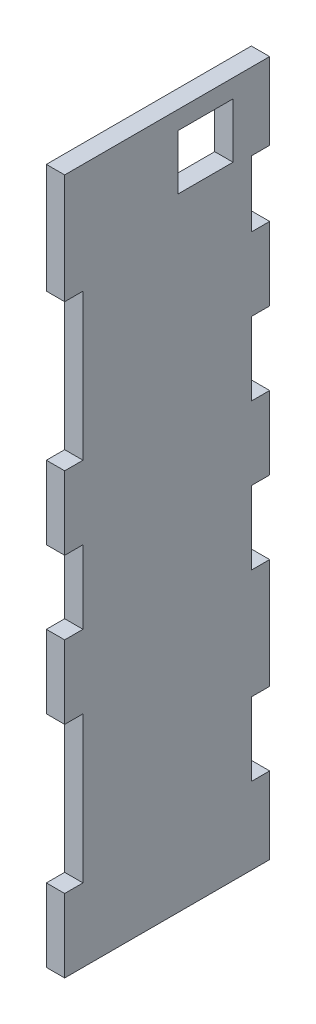
ISO-10303-21;
HEADER;
FILE_DESCRIPTION(('STEP AP214'),'2;1');
FILE_NAME('part.step','',(''),(''),'','','');
FILE_SCHEMA(('AUTOMOTIVE_DESIGN { 1 0 10303 214 1 1 1 1 }'));
ENDSEC;
DATA;
#1=APPLICATION_CONTEXT('core data for automotive mechanical design processes');
#2=APPLICATION_PROTOCOL_DEFINITION('international standard','automotive_design',2000,#1);
#3=PRODUCT_CONTEXT('',#1,'mechanical');
#4=PRODUCT('Part','Part','',(#3));
#5=PRODUCT_RELATED_PRODUCT_CATEGORY('part','',(#4));
#6=PRODUCT_DEFINITION_FORMATION('','',#4);
#7=PRODUCT_DEFINITION_CONTEXT('part definition',#1,'design');
#8=PRODUCT_DEFINITION('design','',#6,#7);
#9=PRODUCT_DEFINITION_SHAPE('','',#8);
#10=(LENGTH_UNIT() NAMED_UNIT(*) SI_UNIT(.MILLI.,.METRE.));
#11=(NAMED_UNIT(*) PLANE_ANGLE_UNIT() SI_UNIT($,.RADIAN.));
#12=(NAMED_UNIT(*) SI_UNIT($,.STERADIAN.) SOLID_ANGLE_UNIT());
#13=UNCERTAINTY_MEASURE_WITH_UNIT(LENGTH_MEASURE(1.E-05),#10,'distance_accuracy_value','');
#14=(GEOMETRIC_REPRESENTATION_CONTEXT(3) GLOBAL_UNCERTAINTY_ASSIGNED_CONTEXT((#13)) GLOBAL_UNIT_ASSIGNED_CONTEXT((#10,
#11,#12)) REPRESENTATION_CONTEXT('',''));
#15=CARTESIAN_POINT('',(0.,0.,0.));
#16=DIRECTION('',(0.,0.,1.));
#17=DIRECTION('',(1.,0.,0.));
#18=AXIS2_PLACEMENT_3D('',#15,#16,#17);
#19=CARTESIAN_POINT('',(0.,0.,0.));
#20=DIRECTION('',(0.,0.,-1.));
#21=DIRECTION('',(-1.,0.,0.));
#22=AXIS2_PLACEMENT_3D('',#19,#20,#21);
#23=PLANE('',#22);
#24=DIRECTION('',(0.,-1.,0.));
#25=VECTOR('',#24,1.);
#26=CARTESIAN_POINT('',(-139.7,-241.3,0.));
#27=LINE('',#26,#25);
#28=CARTESIAN_POINT('',(-139.7,-139.7,0.));
#29=VERTEX_POINT('',#28);
#30=CARTESIAN_POINT('',(-139.7,-165.1,0.));
#31=VERTEX_POINT('',#30);
#32=EDGE_CURVE('E536',#29,#31,#27,.T.);
#33=ORIENTED_EDGE('',*,*,#32,.T.);
#34=DIRECTION('',(1.,0.,0.));
#35=VECTOR('',#34,1.);
#36=CARTESIAN_POINT('',(-139.7,-165.1,0.));
#37=LINE('',#36,#35);
#38=CARTESIAN_POINT('',(-133.35,-165.1,0.));
#39=VERTEX_POINT('',#38);
#40=EDGE_CURVE('E326',#31,#39,#37,.T.);
#41=ORIENTED_EDGE('',*,*,#40,.T.);
#42=DIRECTION('',(0.,1.,0.));
#43=VECTOR('',#42,1.);
#44=CARTESIAN_POINT('',(-133.35,-241.3,0.));
#45=LINE('',#44,#43);
#46=CARTESIAN_POINT('',(-133.35,-139.7,0.));
#47=VERTEX_POINT('',#46);
#48=EDGE_CURVE('E517',#39,#47,#45,.T.);
#49=ORIENTED_EDGE('',*,*,#48,.T.);
#50=DIRECTION('',(1.,0.,0.));
#51=VECTOR('',#50,1.);
#52=CARTESIAN_POINT('',(-139.7,-139.7,0.));
#53=LINE('',#52,#51);
#54=EDGE_CURVE('E335',#29,#47,#53,.T.);
#55=ORIENTED_EDGE('',*,*,#54,.F.);
#56=EDGE_LOOP('',(#33,#41,#49,#55));
#57=FACE_BOUND('',#56,.T.);
#58=ADVANCED_FACE('F36',(#57),#23,.F.);
#59=CARTESIAN_POINT('',(-139.7,-88.9000000000001,0.));
#60=VERTEX_POINT('',#59);
#61=CARTESIAN_POINT('',(-139.7,-114.3,0.));
#62=VERTEX_POINT('',#61);
#63=EDGE_CURVE('E509',#60,#62,#27,.T.);
#64=ORIENTED_EDGE('',*,*,#63,.T.);
#65=DIRECTION('',(1.,0.,0.));
#66=VECTOR('',#65,1.);
#67=CARTESIAN_POINT('',(-139.7,-114.3,0.));
#68=LINE('',#67,#66);
#69=CARTESIAN_POINT('',(-133.35,-114.3,0.));
#70=VERTEX_POINT('',#69);
#71=EDGE_CURVE('E342',#62,#70,#68,.T.);
#72=ORIENTED_EDGE('',*,*,#71,.T.);
#73=CARTESIAN_POINT('',(-133.35,-88.9000000000001,0.));
#74=VERTEX_POINT('',#73);
#75=EDGE_CURVE('E557',#70,#74,#45,.T.);
#76=ORIENTED_EDGE('',*,*,#75,.T.);
#77=DIRECTION('',(1.,0.,0.));
#78=VECTOR('',#77,1.);
#79=CARTESIAN_POINT('',(-139.7,-88.9000000000001,0.));
#80=LINE('',#79,#78);
#81=EDGE_CURVE('E361',#60,#74,#80,.T.);
#82=ORIENTED_EDGE('',*,*,#81,.F.);
#83=EDGE_LOOP('',(#64,#72,#76,#82));
#84=FACE_BOUND('',#83,.T.);
#85=ADVANCED_FACE('F545',(#84),#23,.F.);
#86=CARTESIAN_POINT('',(-139.7,0.,0.));
#87=VERTEX_POINT('',#86);
#88=CARTESIAN_POINT('',(-139.7,-38.1000000000001,0.));
#89=VERTEX_POINT('',#88);
#90=EDGE_CURVE('E505',#87,#89,#27,.T.);
#91=ORIENTED_EDGE('',*,*,#90,.T.);
#92=DIRECTION('',(1.,0.,0.));
#93=VECTOR('',#92,1.);
#94=CARTESIAN_POINT('',(-139.7,-38.1000000000001,0.));
#95=LINE('',#94,#93);
#96=CARTESIAN_POINT('',(-133.35,-38.1000000000001,0.));
#97=VERTEX_POINT('',#96);
#98=EDGE_CURVE('E303',#89,#97,#95,.T.);
#99=ORIENTED_EDGE('',*,*,#98,.T.);
#100=CARTESIAN_POINT('',(-133.35,0.,0.));
#101=VERTEX_POINT('',#100);
#102=EDGE_CURVE('E512',#97,#101,#45,.T.);
#103=ORIENTED_EDGE('',*,*,#102,.T.);
#104=DIRECTION('',(-1.,0.,0.));
#105=VECTOR('',#104,1.);
#106=CARTESIAN_POINT('',(-139.7,0.,0.));
#107=LINE('',#106,#105);
#108=EDGE_CURVE('E516',#101,#87,#107,.T.);
#109=ORIENTED_EDGE('',*,*,#108,.T.);
#110=EDGE_LOOP('',(#91,#99,#103,#109));
#111=FACE_BOUND('',#110,.T.);
#112=ADVANCED_FACE('F562',(#111),#23,.F.);
#113=CARTESIAN_POINT('',(0.,0.,-71.12));
#114=DIRECTION('',(0.,0.,-1.));
#115=DIRECTION('',(-1.,0.,0.));
#116=AXIS2_PLACEMENT_3D('',#113,#114,#115);
#117=PLANE('',#116);
#118=DIRECTION('',(0.,-1.,0.));
#119=VECTOR('',#118,1.);
#120=CARTESIAN_POINT('',(-139.7,-241.3,-71.12));
#121=LINE('',#120,#119);
#122=CARTESIAN_POINT('',(-139.7,-49.5300000000001,-71.12));
#123=VERTEX_POINT('',#122);
#124=CARTESIAN_POINT('',(-139.7,-74.93,-71.12));
#125=VERTEX_POINT('',#124);
#126=EDGE_CURVE('E493',#123,#125,#121,.T.);
#127=ORIENTED_EDGE('',*,*,#126,.F.);
#128=DIRECTION('',(1.,0.,0.));
#129=VECTOR('',#128,1.);
#130=CARTESIAN_POINT('',(-139.7,-49.5300000000001,-71.12));
#131=LINE('',#130,#129);
#132=CARTESIAN_POINT('',(-133.35,-49.5300000000001,-71.12));
#133=VERTEX_POINT('',#132);
#134=EDGE_CURVE('E407',#123,#133,#131,.T.);
#135=ORIENTED_EDGE('',*,*,#134,.T.);
#136=DIRECTION('',(0.,1.,0.));
#137=VECTOR('',#136,1.);
#138=CARTESIAN_POINT('',(-133.35,-241.3,-71.12));
#139=LINE('',#138,#137);
#140=CARTESIAN_POINT('',(-133.35,-74.93,-71.12));
#141=VERTEX_POINT('',#140);
#142=EDGE_CURVE('E1038',#141,#133,#139,.T.);
#143=ORIENTED_EDGE('',*,*,#142,.F.);
#144=DIRECTION('',(1.,0.,0.));
#145=VECTOR('',#144,1.);
#146=CARTESIAN_POINT('',(-139.7,-74.93,-71.12));
#147=LINE('',#146,#145);
#148=EDGE_CURVE('E399',#125,#141,#147,.T.);
#149=ORIENTED_EDGE('',*,*,#148,.F.);
#150=EDGE_LOOP('',(#127,#135,#143,#149));
#151=FACE_BOUND('',#150,.T.);
#152=ADVANCED_FACE('F608',(#151),#117,.T.);
#153=CARTESIAN_POINT('',(-139.7,-100.33,-71.12));
#154=VERTEX_POINT('',#153);
#155=CARTESIAN_POINT('',(-139.7,-125.73,-71.12));
#156=VERTEX_POINT('',#155);
#157=EDGE_CURVE('E1027',#154,#156,#121,.T.);
#158=ORIENTED_EDGE('',*,*,#157,.F.);
#159=DIRECTION('',(1.,0.,0.));
#160=VECTOR('',#159,1.);
#161=CARTESIAN_POINT('',(-139.7,-100.33,-71.12));
#162=LINE('',#161,#160);
#163=CARTESIAN_POINT('',(-133.35,-100.33,-71.12));
#164=VERTEX_POINT('',#163);
#165=EDGE_CURVE('E433',#154,#164,#162,.T.);
#166=ORIENTED_EDGE('',*,*,#165,.T.);
#167=CARTESIAN_POINT('',(-133.35,-125.73,-71.12));
#168=VERTEX_POINT('',#167);
#169=EDGE_CURVE('E1046',#168,#164,#139,.T.);
#170=ORIENTED_EDGE('',*,*,#169,.F.);
#171=DIRECTION('',(1.,0.,0.));
#172=VECTOR('',#171,1.);
#173=CARTESIAN_POINT('',(-139.7,-125.73,-71.12));
#174=LINE('',#173,#172);
#175=EDGE_CURVE('E427',#156,#168,#174,.T.);
#176=ORIENTED_EDGE('',*,*,#175,.F.);
#177=EDGE_LOOP('',(#158,#166,#170,#176));
#178=FACE_BOUND('',#177,.T.);
#179=ADVANCED_FACE('F614',(#178),#117,.T.);
#180=CARTESIAN_POINT('',(-139.7,-151.13,-71.12));
#181=VERTEX_POINT('',#180);
#182=CARTESIAN_POINT('',(-139.7,-189.23,-71.12));
#183=VERTEX_POINT('',#182);
#184=EDGE_CURVE('E1025',#181,#183,#121,.T.);
#185=ORIENTED_EDGE('',*,*,#184,.F.);
#186=DIRECTION('',(1.,0.,0.));
#187=VECTOR('',#186,1.);
#188=CARTESIAN_POINT('',(-139.7,-151.13,-71.12));
#189=LINE('',#188,#187);
#190=CARTESIAN_POINT('',(-133.35,-151.13,-71.12));
#191=VERTEX_POINT('',#190);
#192=EDGE_CURVE('E459',#181,#191,#189,.T.);
#193=ORIENTED_EDGE('',*,*,#192,.T.);
#194=CARTESIAN_POINT('',(-133.35,-189.23,-71.12));
#195=VERTEX_POINT('',#194);
#196=EDGE_CURVE('E502',#195,#191,#139,.T.);
#197=ORIENTED_EDGE('',*,*,#196,.F.);
#198=DIRECTION('',(1.,0.,0.));
#199=VECTOR('',#198,1.);
#200=CARTESIAN_POINT('',(-139.7,-189.23,-71.12));
#201=LINE('',#200,#199);
#202=EDGE_CURVE('E453',#183,#195,#201,.T.);
#203=ORIENTED_EDGE('',*,*,#202,.F.);
#204=EDGE_LOOP('',(#185,#193,#197,#203));
#205=FACE_BOUND('',#204,.T.);
#206=ADVANCED_FACE('F619',(#205),#117,.T.);
#207=CARTESIAN_POINT('',(-139.7,-214.63,-71.12));
#208=VERTEX_POINT('',#207);
#209=CARTESIAN_POINT('',(-139.7,-241.3,-71.12));
#210=VERTEX_POINT('',#209);
#211=EDGE_CURVE('E494',#208,#210,#121,.T.);
#212=ORIENTED_EDGE('',*,*,#211,.F.);
#213=DIRECTION('',(1.,0.,0.));
#214=VECTOR('',#213,1.);
#215=CARTESIAN_POINT('',(-139.7,-214.63,-71.12));
#216=LINE('',#215,#214);
#217=CARTESIAN_POINT('',(-133.35,-214.63,-71.12));
#218=VERTEX_POINT('',#217);
#219=EDGE_CURVE('E483',#208,#218,#216,.T.);
#220=ORIENTED_EDGE('',*,*,#219,.T.);
#221=CARTESIAN_POINT('',(-133.35,-241.3,-71.12));
#222=VERTEX_POINT('',#221);
#223=EDGE_CURVE('E498',#222,#218,#139,.T.);
#224=ORIENTED_EDGE('',*,*,#223,.F.);
#225=DIRECTION('',(1.,0.,0.));
#226=VECTOR('',#225,1.);
#227=CARTESIAN_POINT('',(-139.7,-241.3,-71.12));
#228=LINE('',#227,#226);
#229=EDGE_CURVE('E492',#210,#222,#228,.T.);
#230=ORIENTED_EDGE('',*,*,#229,.F.);
#231=EDGE_LOOP('',(#212,#220,#224,#230));
#232=FACE_BOUND('',#231,.T.);
#233=ADVANCED_FACE('F609',(#232),#117,.T.);
#234=CARTESIAN_POINT('',(-139.7,-241.3,-71.12));
#235=DIRECTION('',(-1.,0.,0.));
#236=DIRECTION('',(0.,0.,1.));
#237=AXIS2_PLACEMENT_3D('',#234,#235,#236);
#238=PLANE('',#237);
#239=DIRECTION('',(0.,1.,0.));
#240=VECTOR('',#239,1.);
#241=CARTESIAN_POINT('',(-139.7,-6.35000000000005,-39.37));
#242=LINE('',#241,#240);
#243=CARTESIAN_POINT('',(-139.7,-25.4000000000001,-39.37));
#244=VERTEX_POINT('',#243);
#245=CARTESIAN_POINT('',(-139.7,-6.35000000000005,-39.37));
#246=VERTEX_POINT('',#245);
#247=EDGE_CURVE('E53',#244,#246,#242,.T.);
#248=ORIENTED_EDGE('',*,*,#247,.F.);
#249=DIRECTION('',(0.,0.,1.));
#250=VECTOR('',#249,1.);
#251=CARTESIAN_POINT('',(-139.7,-25.4000000000001,-39.37));
#252=LINE('',#251,#250);
#253=CARTESIAN_POINT('',(-139.7,-25.4000000000001,-58.42));
#254=VERTEX_POINT('',#253);
#255=EDGE_CURVE('E288',#254,#244,#252,.T.);
#256=ORIENTED_EDGE('',*,*,#255,.F.);
#257=DIRECTION('',(0.,-1.,0.));
#258=VECTOR('',#257,1.);
#259=CARTESIAN_POINT('',(-139.7,-6.35000000000005,-58.42));
#260=LINE('',#259,#258);
#261=CARTESIAN_POINT('',(-139.7,-6.35000000000005,-58.42));
#262=VERTEX_POINT('',#261);
#263=EDGE_CURVE('E291',#262,#254,#260,.T.);
#264=ORIENTED_EDGE('',*,*,#263,.F.);
#265=DIRECTION('',(0.,0.,-1.));
#266=VECTOR('',#265,1.);
#267=CARTESIAN_POINT('',(-139.7,-6.35000000000005,-39.37));
#268=LINE('',#267,#266);
#269=EDGE_CURVE('E297',#246,#262,#268,.T.);
#270=ORIENTED_EDGE('',*,*,#269,.F.);
#271=EDGE_LOOP('',(#248,#256,#264,#270));
#272=FACE_BOUND('',#271,.T.);
#273=DIRECTION('',(0.,0.,1.));
#274=VECTOR('',#273,1.);
#275=CARTESIAN_POINT('',(-139.7,-165.1,0.));
#276=LINE('',#275,#274);
#277=CARTESIAN_POINT('',(-139.7,-165.1,-6.35));
#278=VERTEX_POINT('',#277);
#279=EDGE_CURVE('E314',#278,#31,#276,.T.);
#280=ORIENTED_EDGE('',*,*,#279,.T.);
#281=ORIENTED_EDGE('',*,*,#32,.F.);
#282=DIRECTION('',(0.,0.,-1.));
#283=VECTOR('',#282,1.);
#284=CARTESIAN_POINT('',(-139.7,-139.7,0.));
#285=LINE('',#284,#283);
#286=CARTESIAN_POINT('',(-139.7,-139.7,-6.35));
#287=VERTEX_POINT('',#286);
#288=EDGE_CURVE('E349',#29,#287,#285,.T.);
#289=ORIENTED_EDGE('',*,*,#288,.T.);
#290=DIRECTION('',(0.,1.,0.));
#291=VECTOR('',#290,1.);
#292=CARTESIAN_POINT('',(-139.7,-139.7,-6.35));
#293=LINE('',#292,#291);
#294=CARTESIAN_POINT('',(-139.7,-114.3,-6.35));
#295=VERTEX_POINT('',#294);
#296=EDGE_CURVE('E356',#287,#295,#293,.T.);
#297=ORIENTED_EDGE('',*,*,#296,.T.);
#298=DIRECTION('',(0.,0.,1.));
#299=VECTOR('',#298,1.);
#300=CARTESIAN_POINT('',(-139.7,-114.3,0.));
#301=LINE('',#300,#299);
#302=EDGE_CURVE('E337',#295,#62,#301,.T.);
#303=ORIENTED_EDGE('',*,*,#302,.T.);
#304=ORIENTED_EDGE('',*,*,#63,.F.);
#305=DIRECTION('',(0.,0.,-1.));
#306=VECTOR('',#305,1.);
#307=CARTESIAN_POINT('',(-139.7,-88.9000000000001,0.));
#308=LINE('',#307,#306);
#309=CARTESIAN_POINT('',(-139.7,-88.9000000000001,-6.35));
#310=VERTEX_POINT('',#309);
#311=EDGE_CURVE('E373',#60,#310,#308,.T.);
#312=ORIENTED_EDGE('',*,*,#311,.T.);
#313=DIRECTION('',(0.,1.,0.));
#314=VECTOR('',#313,1.);
#315=CARTESIAN_POINT('',(-139.7,-88.9000000000001,-6.35));
#316=LINE('',#315,#314);
#317=CARTESIAN_POINT('',(-139.7,-38.1000000000001,-6.35));
#318=VERTEX_POINT('',#317);
#319=EDGE_CURVE('E380',#310,#318,#316,.T.);
#320=ORIENTED_EDGE('',*,*,#319,.T.);
#321=DIRECTION('',(0.,0.,1.));
#322=VECTOR('',#321,1.);
#323=CARTESIAN_POINT('',(-139.7,-38.1000000000001,0.));
#324=LINE('',#323,#322);
#325=EDGE_CURVE('E363',#318,#89,#324,.T.);
#326=ORIENTED_EDGE('',*,*,#325,.T.);
#327=ORIENTED_EDGE('',*,*,#90,.F.);
#328=DIRECTION('',(0.,0.,1.));
#329=VECTOR('',#328,1.);
#330=CARTESIAN_POINT('',(-139.7,0.,-71.12));
#331=LINE('',#330,#329);
#332=CARTESIAN_POINT('',(-139.7,0.,-71.12));
#333=VERTEX_POINT('',#332);
#334=EDGE_CURVE('E11',#333,#87,#331,.T.);
#335=ORIENTED_EDGE('',*,*,#334,.F.);
#336=CARTESIAN_POINT('',(-139.7,-26.67,-71.12));
#337=VERTEX_POINT('',#336);
#338=EDGE_CURVE('E489',#333,#337,#121,.T.);
#339=ORIENTED_EDGE('',*,*,#338,.T.);
#340=DIRECTION('',(0.,0.,1.));
#341=VECTOR('',#340,1.);
#342=CARTESIAN_POINT('',(-139.7,-26.67,0.));
#343=LINE('',#342,#341);
#344=CARTESIAN_POINT('',(-139.7,-26.67,-64.77));
#345=VERTEX_POINT('',#344);
#346=EDGE_CURVE('E385',#337,#345,#343,.T.);
#347=ORIENTED_EDGE('',*,*,#346,.T.);
#348=DIRECTION('',(0.,-1.,0.));
#349=VECTOR('',#348,1.);
#350=CARTESIAN_POINT('',(-139.7,0.,-64.77));
#351=LINE('',#350,#349);
#352=CARTESIAN_POINT('',(-139.7,-49.5300000000001,-64.77));
#353=VERTEX_POINT('',#352);
#354=EDGE_CURVE('E388',#345,#353,#351,.T.);
#355=ORIENTED_EDGE('',*,*,#354,.T.);
#356=DIRECTION('',(0.,0.,1.));
#357=VECTOR('',#356,1.);
#358=CARTESIAN_POINT('',(-139.7,-49.5300000000001,0.));
#359=LINE('',#358,#357);
#360=EDGE_CURVE('E392',#123,#353,#359,.T.);
#361=ORIENTED_EDGE('',*,*,#360,.F.);
#362=ORIENTED_EDGE('',*,*,#126,.T.);
#363=DIRECTION('',(0.,0.,1.));
#364=VECTOR('',#363,1.);
#365=CARTESIAN_POINT('',(-139.7,-74.93,0.));
#366=LINE('',#365,#364);
#367=CARTESIAN_POINT('',(-139.7,-74.93,-64.77));
#368=VERTEX_POINT('',#367);
#369=EDGE_CURVE('E413',#125,#368,#366,.T.);
#370=ORIENTED_EDGE('',*,*,#369,.T.);
#371=DIRECTION('',(0.,-1.,0.));
#372=VECTOR('',#371,1.);
#373=CARTESIAN_POINT('',(-139.7,0.,-64.77));
#374=LINE('',#373,#372);
#375=CARTESIAN_POINT('',(-139.7,-100.33,-64.77));
#376=VERTEX_POINT('',#375);
#377=EDGE_CURVE('E416',#368,#376,#374,.T.);
#378=ORIENTED_EDGE('',*,*,#377,.T.);
#379=DIRECTION('',(0.,0.,1.));
#380=VECTOR('',#379,1.);
#381=CARTESIAN_POINT('',(-139.7,-100.33,0.));
#382=LINE('',#381,#380);
#383=EDGE_CURVE('E420',#154,#376,#382,.T.);
#384=ORIENTED_EDGE('',*,*,#383,.F.);
#385=ORIENTED_EDGE('',*,*,#157,.T.);
#386=DIRECTION('',(0.,0.,1.));
#387=VECTOR('',#386,1.);
#388=CARTESIAN_POINT('',(-139.7,-125.73,0.));
#389=LINE('',#388,#387);
#390=CARTESIAN_POINT('',(-139.7,-125.73,-64.77));
#391=VERTEX_POINT('',#390);
#392=EDGE_CURVE('E439',#156,#391,#389,.T.);
#393=ORIENTED_EDGE('',*,*,#392,.T.);
#394=DIRECTION('',(0.,-1.,0.));
#395=VECTOR('',#394,1.);
#396=CARTESIAN_POINT('',(-139.7,0.,-64.77));
#397=LINE('',#396,#395);
#398=CARTESIAN_POINT('',(-139.7,-151.13,-64.77));
#399=VERTEX_POINT('',#398);
#400=EDGE_CURVE('E442',#391,#399,#397,.T.);
#401=ORIENTED_EDGE('',*,*,#400,.T.);
#402=DIRECTION('',(0.,0.,1.));
#403=VECTOR('',#402,1.);
#404=CARTESIAN_POINT('',(-139.7,-151.13,0.));
#405=LINE('',#404,#403);
#406=EDGE_CURVE('E446',#181,#399,#405,.T.);
#407=ORIENTED_EDGE('',*,*,#406,.F.);
#408=ORIENTED_EDGE('',*,*,#184,.T.);
#409=DIRECTION('',(0.,0.,1.));
#410=VECTOR('',#409,1.);
#411=CARTESIAN_POINT('',(-139.7,-189.23,0.));
#412=LINE('',#411,#410);
#413=CARTESIAN_POINT('',(-139.7,-189.23,-64.77));
#414=VERTEX_POINT('',#413);
#415=EDGE_CURVE('E465',#183,#414,#412,.T.);
#416=ORIENTED_EDGE('',*,*,#415,.T.);
#417=DIRECTION('',(0.,-1.,0.));
#418=VECTOR('',#417,1.);
#419=CARTESIAN_POINT('',(-139.7,0.,-64.77));
#420=LINE('',#419,#418);
#421=CARTESIAN_POINT('',(-139.7,-214.63,-64.77));
#422=VERTEX_POINT('',#421);
#423=EDGE_CURVE('E468',#414,#422,#420,.T.);
#424=ORIENTED_EDGE('',*,*,#423,.T.);
#425=DIRECTION('',(0.,0.,1.));
#426=VECTOR('',#425,1.);
#427=CARTESIAN_POINT('',(-139.7,-214.63,0.));
#428=LINE('',#427,#426);
#429=EDGE_CURVE('E472',#208,#422,#428,.T.);
#430=ORIENTED_EDGE('',*,*,#429,.F.);
#431=ORIENTED_EDGE('',*,*,#211,.T.);
#432=DIRECTION('',(0.,0.,1.));
#433=VECTOR('',#432,1.);
#434=CARTESIAN_POINT('',(-139.7,-241.3,-71.12));
#435=LINE('',#434,#433);
#436=CARTESIAN_POINT('',(-139.7,-241.3,0.));
#437=VERTEX_POINT('',#436);
#438=EDGE_CURVE('E40',#210,#437,#435,.T.);
#439=ORIENTED_EDGE('',*,*,#438,.T.);
#440=CARTESIAN_POINT('',(-139.7,-215.9,0.));
#441=VERTEX_POINT('',#440);
#442=EDGE_CURVE('E406',#441,#437,#27,.T.);
#443=ORIENTED_EDGE('',*,*,#442,.F.);
#444=DIRECTION('',(0.,0.,-1.));
#445=VECTOR('',#444,1.);
#446=CARTESIAN_POINT('',(-139.7,-215.9,0.));
#447=LINE('',#446,#445);
#448=CARTESIAN_POINT('',(-139.7,-215.9,-6.35));
#449=VERTEX_POINT('',#448);
#450=EDGE_CURVE('E307',#441,#449,#447,.T.);
#451=ORIENTED_EDGE('',*,*,#450,.T.);
#452=DIRECTION('',(0.,1.,0.));
#453=VECTOR('',#452,1.);
#454=CARTESIAN_POINT('',(-139.7,-215.9,-6.35));
#455=LINE('',#454,#453);
#456=EDGE_CURVE('E310',#449,#278,#455,.T.);
#457=ORIENTED_EDGE('',*,*,#456,.T.);
#458=EDGE_LOOP('',(#280,#281,#289,#297,#303,#304,#312,#320,#326,#327,#335,#339,#347,#355,#361,
#362,#370,#378,#384,#385,#393,#401,#407,#408,#416,#424,#430,#431,#439,#443,#451,#457));
#459=FACE_BOUND('',#458,.T.);
#460=ADVANCED_FACE('F38',(#272,#459),#238,.T.);
#461=CARTESIAN_POINT('',(-139.7,0.,-71.12));
#462=DIRECTION('',(0.,1.,0.));
#463=DIRECTION('',(-1.,0.,0.));
#464=AXIS2_PLACEMENT_3D('',#461,#462,#463);
#465=PLANE('',#464);
#466=ORIENTED_EDGE('',*,*,#108,.F.);
#467=DIRECTION('',(0.,0.,1.));
#468=VECTOR('',#467,1.);
#469=CARTESIAN_POINT('',(-133.35,0.,-71.12));
#470=LINE('',#469,#468);
#471=CARTESIAN_POINT('',(-133.35,0.,-71.12));
#472=VERTEX_POINT('',#471);
#473=EDGE_CURVE('E45',#472,#101,#470,.T.);
#474=ORIENTED_EDGE('',*,*,#473,.F.);
#475=DIRECTION('',(-1.,0.,0.));
#476=VECTOR('',#475,1.);
#477=CARTESIAN_POINT('',(-139.7,0.,-71.12));
#478=LINE('',#477,#476);
#479=EDGE_CURVE('E501',#472,#333,#478,.T.);
#480=ORIENTED_EDGE('',*,*,#479,.T.);
#481=ORIENTED_EDGE('',*,*,#334,.T.);
#482=EDGE_LOOP('',(#466,#474,#480,#481));
#483=FACE_BOUND('',#482,.T.);
#484=ADVANCED_FACE('F570',(#483),#465,.T.);
#485=CARTESIAN_POINT('',(-133.35,-241.3,-71.12));
#486=DIRECTION('',(1.,0.,0.));
#487=DIRECTION('',(0.,0.,-1.));
#488=AXIS2_PLACEMENT_3D('',#485,#486,#487);
#489=PLANE('',#488);
#490=DIRECTION('',(0.,1.,0.));
#491=VECTOR('',#490,1.);
#492=CARTESIAN_POINT('',(-133.35,-6.35000000000005,-39.37));
#493=LINE('',#492,#491);
#494=CARTESIAN_POINT('',(-133.35,-25.4000000000001,-39.37));
#495=VERTEX_POINT('',#494);
#496=CARTESIAN_POINT('',(-133.35,-6.35000000000005,-39.37));
#497=VERTEX_POINT('',#496);
#498=EDGE_CURVE('E272',#495,#497,#493,.T.);
#499=ORIENTED_EDGE('',*,*,#498,.T.);
#500=DIRECTION('',(0.,0.,-1.));
#501=VECTOR('',#500,1.);
#502=CARTESIAN_POINT('',(-133.35,-6.35000000000005,-39.37));
#503=LINE('',#502,#501);
#504=CARTESIAN_POINT('',(-133.35,-6.35000000000005,-58.42));
#505=VERTEX_POINT('',#504);
#506=EDGE_CURVE('E281',#497,#505,#503,.T.);
#507=ORIENTED_EDGE('',*,*,#506,.T.);
#508=DIRECTION('',(0.,-1.,0.));
#509=VECTOR('',#508,1.);
#510=CARTESIAN_POINT('',(-133.35,-6.35000000000005,-58.42));
#511=LINE('',#510,#509);
#512=CARTESIAN_POINT('',(-133.35,-25.4000000000001,-58.42));
#513=VERTEX_POINT('',#512);
#514=EDGE_CURVE('E61',#505,#513,#511,.T.);
#515=ORIENTED_EDGE('',*,*,#514,.T.);
#516=DIRECTION('',(0.,0.,1.));
#517=VECTOR('',#516,1.);
#518=CARTESIAN_POINT('',(-133.35,-25.4000000000001,-39.37));
#519=LINE('',#518,#517);
#520=EDGE_CURVE('E278',#513,#495,#519,.T.);
#521=ORIENTED_EDGE('',*,*,#520,.T.);
#522=EDGE_LOOP('',(#499,#507,#515,#521));
#523=FACE_BOUND('',#522,.T.);
#524=DIRECTION('',(0.,0.,1.));
#525=VECTOR('',#524,1.);
#526=CARTESIAN_POINT('',(-133.35,-165.1,0.));
#527=LINE('',#526,#525);
#528=CARTESIAN_POINT('',(-133.35,-165.1,-6.35));
#529=VERTEX_POINT('',#528);
#530=EDGE_CURVE('E311',#529,#39,#527,.T.);
#531=ORIENTED_EDGE('',*,*,#530,.F.);
#532=DIRECTION('',(0.,1.,0.));
#533=VECTOR('',#532,1.);
#534=CARTESIAN_POINT('',(-133.35,-215.9,-6.35));
#535=LINE('',#534,#533);
#536=CARTESIAN_POINT('',(-133.35,-215.9,-6.35));
#537=VERTEX_POINT('',#536);
#538=EDGE_CURVE('E321',#537,#529,#535,.T.);
#539=ORIENTED_EDGE('',*,*,#538,.F.);
#540=DIRECTION('',(0.,0.,-1.));
#541=VECTOR('',#540,1.);
#542=CARTESIAN_POINT('',(-133.35,-215.9,0.));
#543=LINE('',#542,#541);
#544=CARTESIAN_POINT('',(-133.35,-215.9,0.));
#545=VERTEX_POINT('',#544);
#546=EDGE_CURVE('E318',#545,#537,#543,.T.);
#547=ORIENTED_EDGE('',*,*,#546,.F.);
#548=CARTESIAN_POINT('',(-133.35,-241.3,0.));
#549=VERTEX_POINT('',#548);
#550=EDGE_CURVE('E513',#549,#545,#45,.T.);
#551=ORIENTED_EDGE('',*,*,#550,.F.);
#552=DIRECTION('',(0.,0.,1.));
#553=VECTOR('',#552,1.);
#554=CARTESIAN_POINT('',(-133.35,-241.3,-71.12));
#555=LINE('',#554,#553);
#556=EDGE_CURVE('E521',#222,#549,#555,.T.);
#557=ORIENTED_EDGE('',*,*,#556,.F.);
#558=ORIENTED_EDGE('',*,*,#223,.T.);
#559=DIRECTION('',(0.,0.,1.));
#560=VECTOR('',#559,1.);
#561=CARTESIAN_POINT('',(-133.35,-214.63,0.));
#562=LINE('',#561,#560);
#563=CARTESIAN_POINT('',(-133.35,-214.63,-64.77));
#564=VERTEX_POINT('',#563);
#565=EDGE_CURVE('E469',#218,#564,#562,.T.);
#566=ORIENTED_EDGE('',*,*,#565,.T.);
#567=DIRECTION('',(0.,-1.,0.));
#568=VECTOR('',#567,1.);
#569=CARTESIAN_POINT('',(-133.35,0.,-64.77));
#570=LINE('',#569,#568);
#571=CARTESIAN_POINT('',(-133.35,-189.23,-64.77));
#572=VERTEX_POINT('',#571);
#573=EDGE_CURVE('E477',#572,#564,#570,.T.);
#574=ORIENTED_EDGE('',*,*,#573,.F.);
#575=DIRECTION('',(0.,0.,1.));
#576=VECTOR('',#575,1.);
#577=CARTESIAN_POINT('',(-133.35,-189.23,0.));
#578=LINE('',#577,#576);
#579=EDGE_CURVE('E329',#195,#572,#578,.T.);
#580=ORIENTED_EDGE('',*,*,#579,.F.);
#581=ORIENTED_EDGE('',*,*,#196,.T.);
#582=DIRECTION('',(0.,0.,1.));
#583=VECTOR('',#582,1.);
#584=CARTESIAN_POINT('',(-133.35,-151.13,0.));
#585=LINE('',#584,#583);
#586=CARTESIAN_POINT('',(-133.35,-151.13,-64.77));
#587=VERTEX_POINT('',#586);
#588=EDGE_CURVE('E443',#191,#587,#585,.T.);
#589=ORIENTED_EDGE('',*,*,#588,.T.);
#590=DIRECTION('',(0.,-1.,0.));
#591=VECTOR('',#590,1.);
#592=CARTESIAN_POINT('',(-133.35,0.,-64.77));
#593=LINE('',#592,#591);
#594=CARTESIAN_POINT('',(-133.35,-125.73,-64.77));
#595=VERTEX_POINT('',#594);
#596=EDGE_CURVE('E452',#595,#587,#593,.T.);
#597=ORIENTED_EDGE('',*,*,#596,.F.);
#598=DIRECTION('',(0.,0.,1.));
#599=VECTOR('',#598,1.);
#600=CARTESIAN_POINT('',(-133.35,-125.73,0.));
#601=LINE('',#600,#599);
#602=EDGE_CURVE('E449',#168,#595,#601,.T.);
#603=ORIENTED_EDGE('',*,*,#602,.F.);
#604=ORIENTED_EDGE('',*,*,#169,.T.);
#605=DIRECTION('',(0.,0.,1.));
#606=VECTOR('',#605,1.);
#607=CARTESIAN_POINT('',(-133.35,-100.33,0.));
#608=LINE('',#607,#606);
#609=CARTESIAN_POINT('',(-133.35,-100.33,-64.77));
#610=VERTEX_POINT('',#609);
#611=EDGE_CURVE('E417',#164,#610,#608,.T.);
#612=ORIENTED_EDGE('',*,*,#611,.T.);
#613=DIRECTION('',(0.,-1.,0.));
#614=VECTOR('',#613,1.);
#615=CARTESIAN_POINT('',(-133.35,0.,-64.77));
#616=LINE('',#615,#614);
#617=CARTESIAN_POINT('',(-133.35,-74.93,-64.77));
#618=VERTEX_POINT('',#617);
#619=EDGE_CURVE('E426',#618,#610,#616,.T.);
#620=ORIENTED_EDGE('',*,*,#619,.F.);
#621=DIRECTION('',(0.,0.,1.));
#622=VECTOR('',#621,1.);
#623=CARTESIAN_POINT('',(-133.35,-74.93,0.));
#624=LINE('',#623,#622);
#625=EDGE_CURVE('E423',#141,#618,#624,.T.);
#626=ORIENTED_EDGE('',*,*,#625,.F.);
#627=ORIENTED_EDGE('',*,*,#142,.T.);
#628=DIRECTION('',(0.,0.,1.));
#629=VECTOR('',#628,1.);
#630=CARTESIAN_POINT('',(-133.35,-49.5300000000001,0.));
#631=LINE('',#630,#629);
#632=CARTESIAN_POINT('',(-133.35,-49.5300000000001,-64.77));
#633=VERTEX_POINT('',#632);
#634=EDGE_CURVE('E389',#133,#633,#631,.T.);
#635=ORIENTED_EDGE('',*,*,#634,.T.);
#636=DIRECTION('',(0.,-1.,0.));
#637=VECTOR('',#636,1.);
#638=CARTESIAN_POINT('',(-133.35,0.,-64.77));
#639=LINE('',#638,#637);
#640=CARTESIAN_POINT('',(-133.35,-26.67,-64.77));
#641=VERTEX_POINT('',#640);
#642=EDGE_CURVE('E398',#641,#633,#639,.T.);
#643=ORIENTED_EDGE('',*,*,#642,.F.);
#644=DIRECTION('',(0.,0.,1.));
#645=VECTOR('',#644,1.);
#646=CARTESIAN_POINT('',(-133.35,-26.67,0.));
#647=LINE('',#646,#645);
#648=CARTESIAN_POINT('',(-133.35,-26.67,-71.12));
#649=VERTEX_POINT('',#648);
#650=EDGE_CURVE('E395',#649,#641,#647,.T.);
#651=ORIENTED_EDGE('',*,*,#650,.F.);
#652=EDGE_CURVE('E497',#649,#472,#139,.T.);
#653=ORIENTED_EDGE('',*,*,#652,.T.);
#654=ORIENTED_EDGE('',*,*,#473,.T.);
#655=ORIENTED_EDGE('',*,*,#102,.F.);
#656=DIRECTION('',(0.,0.,1.));
#657=VECTOR('',#656,1.);
#658=CARTESIAN_POINT('',(-133.35,-38.1000000000001,0.));
#659=LINE('',#658,#657);
#660=CARTESIAN_POINT('',(-133.35,-38.1000000000001,-6.35));
#661=VERTEX_POINT('',#660);
#662=EDGE_CURVE('E370',#661,#97,#659,.T.);
#663=ORIENTED_EDGE('',*,*,#662,.F.);
#664=DIRECTION('',(0.,1.,0.));
#665=VECTOR('',#664,1.);
#666=CARTESIAN_POINT('',(-133.35,-88.9000000000001,-6.35));
#667=LINE('',#666,#665);
#668=CARTESIAN_POINT('',(-133.35,-88.9000000000001,-6.35));
#669=VERTEX_POINT('',#668);
#670=EDGE_CURVE('E372',#669,#661,#667,.T.);
#671=ORIENTED_EDGE('',*,*,#670,.F.);
#672=DIRECTION('',(0.,0.,-1.));
#673=VECTOR('',#672,1.);
#674=CARTESIAN_POINT('',(-133.35,-88.9000000000001,0.));
#675=LINE('',#674,#673);
#676=EDGE_CURVE('E345',#74,#669,#675,.T.);
#677=ORIENTED_EDGE('',*,*,#676,.F.);
#678=ORIENTED_EDGE('',*,*,#75,.F.);
#679=DIRECTION('',(0.,0.,1.));
#680=VECTOR('',#679,1.);
#681=CARTESIAN_POINT('',(-133.35,-114.3,0.));
#682=LINE('',#681,#680);
#683=CARTESIAN_POINT('',(-133.35,-114.3,-6.35));
#684=VERTEX_POINT('',#683);
#685=EDGE_CURVE('E346',#684,#70,#682,.T.);
#686=ORIENTED_EDGE('',*,*,#685,.F.);
#687=DIRECTION('',(0.,1.,0.));
#688=VECTOR('',#687,1.);
#689=CARTESIAN_POINT('',(-133.35,-139.7,-6.35));
#690=LINE('',#689,#688);
#691=CARTESIAN_POINT('',(-133.35,-139.7,-6.35));
#692=VERTEX_POINT('',#691);
#693=EDGE_CURVE('E348',#692,#684,#690,.T.);
#694=ORIENTED_EDGE('',*,*,#693,.F.);
#695=DIRECTION('',(0.,0.,-1.));
#696=VECTOR('',#695,1.);
#697=CARTESIAN_POINT('',(-133.35,-139.7,0.));
#698=LINE('',#697,#696);
#699=EDGE_CURVE('E322',#47,#692,#698,.T.);
#700=ORIENTED_EDGE('',*,*,#699,.F.);
#701=ORIENTED_EDGE('',*,*,#48,.F.);
#702=EDGE_LOOP('',(#531,#539,#547,#551,#557,#558,#566,#574,#580,#581,#589,#597,#603,#604,#612,
#620,#626,#627,#635,#643,#651,#653,#654,#655,#663,#671,#677,#678,#686,#694,#700,#701));
#703=FACE_BOUND('',#702,.T.);
#704=ADVANCED_FACE('F285',(#523,#703),#489,.T.);
#705=CARTESIAN_POINT('',(-139.7,-241.3,-71.12));
#706=DIRECTION('',(0.,-1.,0.));
#707=DIRECTION('',(0.,0.,-1.));
#708=AXIS2_PLACEMENT_3D('',#705,#706,#707);
#709=PLANE('',#708);
#710=DIRECTION('',(1.,0.,0.));
#711=VECTOR('',#710,1.);
#712=CARTESIAN_POINT('',(-139.7,-241.3,0.));
#713=LINE('',#712,#711);
#714=EDGE_CURVE('E508',#437,#549,#713,.T.);
#715=ORIENTED_EDGE('',*,*,#714,.F.);
#716=ORIENTED_EDGE('',*,*,#438,.F.);
#717=ORIENTED_EDGE('',*,*,#229,.T.);
#718=ORIENTED_EDGE('',*,*,#556,.T.);
#719=EDGE_LOOP('',(#715,#716,#717,#718));
#720=FACE_BOUND('',#719,.T.);
#721=ADVANCED_FACE('F532',(#720),#709,.T.);
#722=DIRECTION('',(1.,0.,0.));
#723=VECTOR('',#722,1.);
#724=CARTESIAN_POINT('',(-139.7,-26.67,-71.12));
#725=LINE('',#724,#723);
#726=EDGE_CURVE('E404',#337,#649,#725,.T.);
#727=ORIENTED_EDGE('',*,*,#726,.F.);
#728=ORIENTED_EDGE('',*,*,#338,.F.);
#729=ORIENTED_EDGE('',*,*,#479,.F.);
#730=ORIENTED_EDGE('',*,*,#652,.F.);
#731=EDGE_LOOP('',(#727,#728,#729,#730));
#732=FACE_BOUND('',#731,.T.);
#733=ADVANCED_FACE('F599',(#732),#117,.T.);
#734=ORIENTED_EDGE('',*,*,#550,.T.);
#735=DIRECTION('',(1.,0.,0.));
#736=VECTOR('',#735,1.);
#737=CARTESIAN_POINT('',(-139.7,-215.9,0.));
#738=LINE('',#737,#736);
#739=EDGE_CURVE('E317',#441,#545,#738,.T.);
#740=ORIENTED_EDGE('',*,*,#739,.F.);
#741=ORIENTED_EDGE('',*,*,#442,.T.);
#742=ORIENTED_EDGE('',*,*,#714,.T.);
#743=EDGE_LOOP('',(#734,#740,#741,#742));
#744=FACE_BOUND('',#743,.T.);
#745=ADVANCED_FACE('F534',(#744),#23,.F.);
#746=CARTESIAN_POINT('',(-139.7,-189.23,0.));
#747=DIRECTION('',(0.,1.,0.));
#748=DIRECTION('',(0.,0.,1.));
#749=AXIS2_PLACEMENT_3D('',#746,#747,#748);
#750=PLANE('',#749);
#751=ORIENTED_EDGE('',*,*,#579,.T.);
#752=DIRECTION('',(1.,0.,0.));
#753=VECTOR('',#752,1.);
#754=CARTESIAN_POINT('',(-139.7,-189.23,-64.77));
#755=LINE('',#754,#753);
#756=EDGE_CURVE('E474',#414,#572,#755,.T.);
#757=ORIENTED_EDGE('',*,*,#756,.F.);
#758=ORIENTED_EDGE('',*,*,#415,.F.);
#759=ORIENTED_EDGE('',*,*,#202,.T.);
#760=EDGE_LOOP('',(#751,#757,#758,#759));
#761=FACE_BOUND('',#760,.T.);
#762=ADVANCED_FACE('F598',(#761),#750,.F.);
#763=CARTESIAN_POINT('',(-139.7,-214.63,0.));
#764=DIRECTION('',(0.,1.,0.));
#765=DIRECTION('',(0.,0.,1.));
#766=AXIS2_PLACEMENT_3D('',#763,#764,#765);
#767=PLANE('',#766);
#768=ORIENTED_EDGE('',*,*,#565,.F.);
#769=ORIENTED_EDGE('',*,*,#219,.F.);
#770=ORIENTED_EDGE('',*,*,#429,.T.);
#771=DIRECTION('',(1.,0.,0.));
#772=VECTOR('',#771,1.);
#773=CARTESIAN_POINT('',(-139.7,-214.63,-64.77));
#774=LINE('',#773,#772);
#775=EDGE_CURVE('E486',#422,#564,#774,.T.);
#776=ORIENTED_EDGE('',*,*,#775,.T.);
#777=EDGE_LOOP('',(#768,#769,#770,#776));
#778=FACE_BOUND('',#777,.T.);
#779=ADVANCED_FACE('F604',(#778),#767,.T.);
#780=CARTESIAN_POINT('',(-139.7,0.,-64.77));
#781=DIRECTION('',(0.,0.,1.));
#782=DIRECTION('',(1.,0.,0.));
#783=AXIS2_PLACEMENT_3D('',#780,#781,#782);
#784=PLANE('',#783);
#785=ORIENTED_EDGE('',*,*,#573,.T.);
#786=ORIENTED_EDGE('',*,*,#775,.F.);
#787=ORIENTED_EDGE('',*,*,#423,.F.);
#788=ORIENTED_EDGE('',*,*,#756,.T.);
#789=EDGE_LOOP('',(#785,#786,#787,#788));
#790=FACE_BOUND('',#789,.T.);
#791=ADVANCED_FACE('F623',(#790),#784,.F.);
#792=CARTESIAN_POINT('',(-139.7,-125.73,0.));
#793=DIRECTION('',(0.,1.,0.));
#794=DIRECTION('',(0.,0.,1.));
#795=AXIS2_PLACEMENT_3D('',#792,#793,#794);
#796=PLANE('',#795);
#797=ORIENTED_EDGE('',*,*,#602,.T.);
#798=DIRECTION('',(1.,0.,0.));
#799=VECTOR('',#798,1.);
#800=CARTESIAN_POINT('',(-139.7,-125.73,-64.77));
#801=LINE('',#800,#799);
#802=EDGE_CURVE('E448',#391,#595,#801,.T.);
#803=ORIENTED_EDGE('',*,*,#802,.F.);
#804=ORIENTED_EDGE('',*,*,#392,.F.);
#805=ORIENTED_EDGE('',*,*,#175,.T.);
#806=EDGE_LOOP('',(#797,#803,#804,#805));
#807=FACE_BOUND('',#806,.T.);
#808=ADVANCED_FACE('F626',(#807),#796,.F.);
#809=CARTESIAN_POINT('',(-139.7,-151.13,0.));
#810=DIRECTION('',(0.,1.,0.));
#811=DIRECTION('',(0.,0.,1.));
#812=AXIS2_PLACEMENT_3D('',#809,#810,#811);
#813=PLANE('',#812);
#814=ORIENTED_EDGE('',*,*,#588,.F.);
#815=ORIENTED_EDGE('',*,*,#192,.F.);
#816=ORIENTED_EDGE('',*,*,#406,.T.);
#817=DIRECTION('',(1.,0.,0.));
#818=VECTOR('',#817,1.);
#819=CARTESIAN_POINT('',(-139.7,-151.13,-64.77));
#820=LINE('',#819,#818);
#821=EDGE_CURVE('E462',#399,#587,#820,.T.);
#822=ORIENTED_EDGE('',*,*,#821,.T.);
#823=EDGE_LOOP('',(#814,#815,#816,#822));
#824=FACE_BOUND('',#823,.T.);
#825=ADVANCED_FACE('F633',(#824),#813,.T.);
#826=CARTESIAN_POINT('',(-139.7,0.,-64.77));
#827=DIRECTION('',(0.,0.,1.));
#828=DIRECTION('',(1.,0.,0.));
#829=AXIS2_PLACEMENT_3D('',#826,#827,#828);
#830=PLANE('',#829);
#831=ORIENTED_EDGE('',*,*,#596,.T.);
#832=ORIENTED_EDGE('',*,*,#821,.F.);
#833=ORIENTED_EDGE('',*,*,#400,.F.);
#834=ORIENTED_EDGE('',*,*,#802,.T.);
#835=EDGE_LOOP('',(#831,#832,#833,#834));
#836=FACE_BOUND('',#835,.T.);
#837=ADVANCED_FACE('F635',(#836),#830,.F.);
#838=CARTESIAN_POINT('',(-139.7,-74.93,0.));
#839=DIRECTION('',(0.,1.,0.));
#840=DIRECTION('',(0.,0.,1.));
#841=AXIS2_PLACEMENT_3D('',#838,#839,#840);
#842=PLANE('',#841);
#843=ORIENTED_EDGE('',*,*,#625,.T.);
#844=DIRECTION('',(1.,0.,0.));
#845=VECTOR('',#844,1.);
#846=CARTESIAN_POINT('',(-139.7,-74.93,-64.77));
#847=LINE('',#846,#845);
#848=EDGE_CURVE('E422',#368,#618,#847,.T.);
#849=ORIENTED_EDGE('',*,*,#848,.F.);
#850=ORIENTED_EDGE('',*,*,#369,.F.);
#851=ORIENTED_EDGE('',*,*,#148,.T.);
#852=EDGE_LOOP('',(#843,#849,#850,#851));
#853=FACE_BOUND('',#852,.T.);
#854=ADVANCED_FACE('F638',(#853),#842,.F.);
#855=CARTESIAN_POINT('',(-139.7,-100.33,0.));
#856=DIRECTION('',(0.,1.,0.));
#857=DIRECTION('',(0.,0.,1.));
#858=AXIS2_PLACEMENT_3D('',#855,#856,#857);
#859=PLANE('',#858);
#860=ORIENTED_EDGE('',*,*,#611,.F.);
#861=ORIENTED_EDGE('',*,*,#165,.F.);
#862=ORIENTED_EDGE('',*,*,#383,.T.);
#863=DIRECTION('',(1.,0.,0.));
#864=VECTOR('',#863,1.);
#865=CARTESIAN_POINT('',(-139.7,-100.33,-64.77));
#866=LINE('',#865,#864);
#867=EDGE_CURVE('E436',#376,#610,#866,.T.);
#868=ORIENTED_EDGE('',*,*,#867,.T.);
#869=EDGE_LOOP('',(#860,#861,#862,#868));
#870=FACE_BOUND('',#869,.T.);
#871=ADVANCED_FACE('F645',(#870),#859,.T.);
#872=CARTESIAN_POINT('',(-139.7,0.,-64.77));
#873=DIRECTION('',(0.,0.,1.));
#874=DIRECTION('',(1.,0.,0.));
#875=AXIS2_PLACEMENT_3D('',#872,#873,#874);
#876=PLANE('',#875);
#877=ORIENTED_EDGE('',*,*,#619,.T.);
#878=ORIENTED_EDGE('',*,*,#867,.F.);
#879=ORIENTED_EDGE('',*,*,#377,.F.);
#880=ORIENTED_EDGE('',*,*,#848,.T.);
#881=EDGE_LOOP('',(#877,#878,#879,#880));
#882=FACE_BOUND('',#881,.T.);
#883=ADVANCED_FACE('F647',(#882),#876,.F.);
#884=CARTESIAN_POINT('',(-139.7,-26.67,0.));
#885=DIRECTION('',(0.,1.,0.));
#886=DIRECTION('',(0.,0.,1.));
#887=AXIS2_PLACEMENT_3D('',#884,#885,#886);
#888=PLANE('',#887);
#889=ORIENTED_EDGE('',*,*,#650,.T.);
#890=DIRECTION('',(1.,0.,0.));
#891=VECTOR('',#890,1.);
#892=CARTESIAN_POINT('',(-139.7,-26.67,-64.77));
#893=LINE('',#892,#891);
#894=EDGE_CURVE('E394',#345,#641,#893,.T.);
#895=ORIENTED_EDGE('',*,*,#894,.F.);
#896=ORIENTED_EDGE('',*,*,#346,.F.);
#897=ORIENTED_EDGE('',*,*,#726,.T.);
#898=EDGE_LOOP('',(#889,#895,#896,#897));
#899=FACE_BOUND('',#898,.T.);
#900=ADVANCED_FACE('F650',(#899),#888,.F.);
#901=CARTESIAN_POINT('',(-139.7,-49.5300000000001,0.));
#902=DIRECTION('',(0.,1.,0.));
#903=DIRECTION('',(0.,0.,1.));
#904=AXIS2_PLACEMENT_3D('',#901,#902,#903);
#905=PLANE('',#904);
#906=ORIENTED_EDGE('',*,*,#634,.F.);
#907=ORIENTED_EDGE('',*,*,#134,.F.);
#908=ORIENTED_EDGE('',*,*,#360,.T.);
#909=DIRECTION('',(1.,0.,0.));
#910=VECTOR('',#909,1.);
#911=CARTESIAN_POINT('',(-139.7,-49.5300000000001,-64.77));
#912=LINE('',#911,#910);
#913=EDGE_CURVE('E410',#353,#633,#912,.T.);
#914=ORIENTED_EDGE('',*,*,#913,.T.);
#915=EDGE_LOOP('',(#906,#907,#908,#914));
#916=FACE_BOUND('',#915,.T.);
#917=ADVANCED_FACE('F657',(#916),#905,.T.);
#918=CARTESIAN_POINT('',(-139.7,0.,-64.77));
#919=DIRECTION('',(0.,0.,1.));
#920=DIRECTION('',(1.,0.,0.));
#921=AXIS2_PLACEMENT_3D('',#918,#919,#920);
#922=PLANE('',#921);
#923=ORIENTED_EDGE('',*,*,#642,.T.);
#924=ORIENTED_EDGE('',*,*,#913,.F.);
#925=ORIENTED_EDGE('',*,*,#354,.F.);
#926=ORIENTED_EDGE('',*,*,#894,.T.);
#927=EDGE_LOOP('',(#923,#924,#925,#926));
#928=FACE_BOUND('',#927,.T.);
#929=ADVANCED_FACE('F659',(#928),#922,.F.);
#930=CARTESIAN_POINT('',(-139.7,-38.1000000000001,0.));
#931=DIRECTION('',(0.,1.,0.));
#932=DIRECTION('',(0.,0.,1.));
#933=AXIS2_PLACEMENT_3D('',#930,#931,#932);
#934=PLANE('',#933);
#935=ORIENTED_EDGE('',*,*,#662,.T.);
#936=ORIENTED_EDGE('',*,*,#98,.F.);
#937=ORIENTED_EDGE('',*,*,#325,.F.);
#938=DIRECTION('',(1.,0.,0.));
#939=VECTOR('',#938,1.);
#940=CARTESIAN_POINT('',(-139.7,-38.1000000000001,-6.35));
#941=LINE('',#940,#939);
#942=EDGE_CURVE('E366',#318,#661,#941,.T.);
#943=ORIENTED_EDGE('',*,*,#942,.T.);
#944=EDGE_LOOP('',(#935,#936,#937,#943));
#945=FACE_BOUND('',#944,.T.);
#946=ADVANCED_FACE('F576',(#945),#934,.F.);
#947=CARTESIAN_POINT('',(-139.7,-88.9000000000001,-6.35));
#948=DIRECTION('',(0.,0.,-1.));
#949=DIRECTION('',(-1.,0.,0.));
#950=AXIS2_PLACEMENT_3D('',#947,#948,#949);
#951=PLANE('',#950);
#952=ORIENTED_EDGE('',*,*,#670,.T.);
#953=ORIENTED_EDGE('',*,*,#942,.F.);
#954=ORIENTED_EDGE('',*,*,#319,.F.);
#955=DIRECTION('',(1.,0.,0.));
#956=VECTOR('',#955,1.);
#957=CARTESIAN_POINT('',(-139.7,-88.9000000000001,-6.35));
#958=LINE('',#957,#956);
#959=EDGE_CURVE('E364',#310,#669,#958,.T.);
#960=ORIENTED_EDGE('',*,*,#959,.T.);
#961=EDGE_LOOP('',(#952,#953,#954,#960));
#962=FACE_BOUND('',#961,.T.);
#963=ADVANCED_FACE('F578',(#962),#951,.F.);
#964=CARTESIAN_POINT('',(-139.7,-88.9000000000001,0.));
#965=DIRECTION('',(0.,-1.,0.));
#966=DIRECTION('',(0.,0.,-1.));
#967=AXIS2_PLACEMENT_3D('',#964,#965,#966);
#968=PLANE('',#967);
#969=ORIENTED_EDGE('',*,*,#676,.T.);
#970=ORIENTED_EDGE('',*,*,#959,.F.);
#971=ORIENTED_EDGE('',*,*,#311,.F.);
#972=ORIENTED_EDGE('',*,*,#81,.T.);
#973=EDGE_LOOP('',(#969,#970,#971,#972));
#974=FACE_BOUND('',#973,.T.);
#975=ADVANCED_FACE('F580',(#974),#968,.F.);
#976=CARTESIAN_POINT('',(-139.7,-114.3,0.));
#977=DIRECTION('',(0.,1.,0.));
#978=DIRECTION('',(0.,0.,1.));
#979=AXIS2_PLACEMENT_3D('',#976,#977,#978);
#980=PLANE('',#979);
#981=ORIENTED_EDGE('',*,*,#685,.T.);
#982=ORIENTED_EDGE('',*,*,#71,.F.);
#983=ORIENTED_EDGE('',*,*,#302,.F.);
#984=DIRECTION('',(1.,0.,0.));
#985=VECTOR('',#984,1.);
#986=CARTESIAN_POINT('',(-139.7,-114.3,-6.35));
#987=LINE('',#986,#985);
#988=EDGE_CURVE('E340',#295,#684,#987,.T.);
#989=ORIENTED_EDGE('',*,*,#988,.T.);
#990=EDGE_LOOP('',(#981,#982,#983,#989));
#991=FACE_BOUND('',#990,.T.);
#992=ADVANCED_FACE('F551',(#991),#980,.F.);
#993=CARTESIAN_POINT('',(-139.7,-139.7,-6.35));
#994=DIRECTION('',(0.,0.,-1.));
#995=DIRECTION('',(-1.,0.,0.));
#996=AXIS2_PLACEMENT_3D('',#993,#994,#995);
#997=PLANE('',#996);
#998=ORIENTED_EDGE('',*,*,#693,.T.);
#999=ORIENTED_EDGE('',*,*,#988,.F.);
#1000=ORIENTED_EDGE('',*,*,#296,.F.);
#1001=DIRECTION('',(1.,0.,0.));
#1002=VECTOR('',#1001,1.);
#1003=CARTESIAN_POINT('',(-139.7,-139.7,-6.35));
#1004=LINE('',#1003,#1002);
#1005=EDGE_CURVE('E338',#287,#692,#1004,.T.);
#1006=ORIENTED_EDGE('',*,*,#1005,.T.);
#1007=EDGE_LOOP('',(#998,#999,#1000,#1006));
#1008=FACE_BOUND('',#1007,.T.);
#1009=ADVANCED_FACE('F587',(#1008),#997,.F.);
#1010=CARTESIAN_POINT('',(-139.7,-139.7,0.));
#1011=DIRECTION('',(0.,-1.,0.));
#1012=DIRECTION('',(0.,0.,-1.));
#1013=AXIS2_PLACEMENT_3D('',#1010,#1011,#1012);
#1014=PLANE('',#1013);
#1015=ORIENTED_EDGE('',*,*,#699,.T.);
#1016=ORIENTED_EDGE('',*,*,#1005,.F.);
#1017=ORIENTED_EDGE('',*,*,#288,.F.);
#1018=ORIENTED_EDGE('',*,*,#54,.T.);
#1019=EDGE_LOOP('',(#1015,#1016,#1017,#1018));
#1020=FACE_BOUND('',#1019,.T.);
#1021=ADVANCED_FACE('F697',(#1020),#1014,.F.);
#1022=CARTESIAN_POINT('',(-139.7,-165.1,0.));
#1023=DIRECTION('',(0.,1.,0.));
#1024=DIRECTION('',(0.,0.,1.));
#1025=AXIS2_PLACEMENT_3D('',#1022,#1023,#1024);
#1026=PLANE('',#1025);
#1027=ORIENTED_EDGE('',*,*,#530,.T.);
#1028=ORIENTED_EDGE('',*,*,#40,.F.);
#1029=ORIENTED_EDGE('',*,*,#279,.F.);
#1030=DIRECTION('',(1.,0.,0.));
#1031=VECTOR('',#1030,1.);
#1032=CARTESIAN_POINT('',(-139.7,-165.1,-6.35));
#1033=LINE('',#1032,#1031);
#1034=EDGE_CURVE('E330',#278,#529,#1033,.T.);
#1035=ORIENTED_EDGE('',*,*,#1034,.T.);
#1036=EDGE_LOOP('',(#1027,#1028,#1029,#1035));
#1037=FACE_BOUND('',#1036,.T.);
#1038=ADVANCED_FACE('F708',(#1037),#1026,.F.);
#1039=CARTESIAN_POINT('',(-139.7,-215.9,-6.35));
#1040=DIRECTION('',(0.,0.,-1.));
#1041=DIRECTION('',(-1.,0.,0.));
#1042=AXIS2_PLACEMENT_3D('',#1039,#1040,#1041);
#1043=PLANE('',#1042);
#1044=ORIENTED_EDGE('',*,*,#538,.T.);
#1045=ORIENTED_EDGE('',*,*,#1034,.F.);
#1046=ORIENTED_EDGE('',*,*,#456,.F.);
#1047=DIRECTION('',(1.,0.,0.));
#1048=VECTOR('',#1047,1.);
#1049=CARTESIAN_POINT('',(-139.7,-215.9,-6.35));
#1050=LINE('',#1049,#1048);
#1051=EDGE_CURVE('E332',#449,#537,#1050,.T.);
#1052=ORIENTED_EDGE('',*,*,#1051,.T.);
#1053=EDGE_LOOP('',(#1044,#1045,#1046,#1052));
#1054=FACE_BOUND('',#1053,.T.);
#1055=ADVANCED_FACE('F719',(#1054),#1043,.F.);
#1056=CARTESIAN_POINT('',(-139.7,-215.9,0.));
#1057=DIRECTION('',(0.,-1.,0.));
#1058=DIRECTION('',(0.,0.,-1.));
#1059=AXIS2_PLACEMENT_3D('',#1056,#1057,#1058);
#1060=PLANE('',#1059);
#1061=ORIENTED_EDGE('',*,*,#546,.T.);
#1062=ORIENTED_EDGE('',*,*,#1051,.F.);
#1063=ORIENTED_EDGE('',*,*,#450,.F.);
#1064=ORIENTED_EDGE('',*,*,#739,.T.);
#1065=EDGE_LOOP('',(#1061,#1062,#1063,#1064));
#1066=FACE_BOUND('',#1065,.T.);
#1067=ADVANCED_FACE('F730',(#1066),#1060,.F.);
#1068=CARTESIAN_POINT('',(-133.35,-6.35000000000005,-39.37));
#1069=DIRECTION('',(0.,0.,1.));
#1070=DIRECTION('',(1.,0.,0.));
#1071=AXIS2_PLACEMENT_3D('',#1068,#1069,#1070);
#1072=PLANE('',#1071);
#1073=ORIENTED_EDGE('',*,*,#247,.T.);
#1074=DIRECTION('',(-1.,0.,0.));
#1075=VECTOR('',#1074,1.);
#1076=CARTESIAN_POINT('',(-133.35,-6.35000000000005,-39.37));
#1077=LINE('',#1076,#1075);
#1078=EDGE_CURVE('E268',#497,#246,#1077,.T.);
#1079=ORIENTED_EDGE('',*,*,#1078,.F.);
#1080=ORIENTED_EDGE('',*,*,#498,.F.);
#1081=DIRECTION('',(-1.,0.,0.));
#1082=VECTOR('',#1081,1.);
#1083=CARTESIAN_POINT('',(-133.35,-25.4000000000001,-39.37));
#1084=LINE('',#1083,#1082);
#1085=EDGE_CURVE('E301',#495,#244,#1084,.T.);
#1086=ORIENTED_EDGE('',*,*,#1085,.T.);
#1087=EDGE_LOOP('',(#1073,#1079,#1080,#1086));
#1088=FACE_BOUND('',#1087,.T.);
#1089=ADVANCED_FACE('F270',(#1088),#1072,.F.);
#1090=CARTESIAN_POINT('',(-133.35,-25.4000000000001,-39.37));
#1091=DIRECTION('',(0.,-1.,0.));
#1092=DIRECTION('',(0.,0.,-1.));
#1093=AXIS2_PLACEMENT_3D('',#1090,#1091,#1092);
#1094=PLANE('',#1093);
#1095=ORIENTED_EDGE('',*,*,#255,.T.);
#1096=ORIENTED_EDGE('',*,*,#1085,.F.);
#1097=ORIENTED_EDGE('',*,*,#520,.F.);
#1098=DIRECTION('',(-1.,0.,0.));
#1099=VECTOR('',#1098,1.);
#1100=CARTESIAN_POINT('',(-133.35,-25.4000000000001,-58.42));
#1101=LINE('',#1100,#1099);
#1102=EDGE_CURVE('E304',#513,#254,#1101,.T.);
#1103=ORIENTED_EDGE('',*,*,#1102,.T.);
#1104=EDGE_LOOP('',(#1095,#1096,#1097,#1103));
#1105=FACE_BOUND('',#1104,.T.);
#1106=ADVANCED_FACE('F774',(#1105),#1094,.F.);
#1107=CARTESIAN_POINT('',(-133.35,-6.35000000000005,-58.42));
#1108=DIRECTION('',(0.,0.,-1.));
#1109=DIRECTION('',(-1.,0.,0.));
#1110=AXIS2_PLACEMENT_3D('',#1107,#1108,#1109);
#1111=PLANE('',#1110);
#1112=ORIENTED_EDGE('',*,*,#263,.T.);
#1113=ORIENTED_EDGE('',*,*,#1102,.F.);
#1114=ORIENTED_EDGE('',*,*,#514,.F.);
#1115=DIRECTION('',(-1.,0.,0.));
#1116=VECTOR('',#1115,1.);
#1117=CARTESIAN_POINT('',(-133.35,-6.35000000000005,-58.42));
#1118=LINE('',#1117,#1116);
#1119=EDGE_CURVE('E277',#505,#262,#1118,.T.);
#1120=ORIENTED_EDGE('',*,*,#1119,.T.);
#1121=EDGE_LOOP('',(#1112,#1113,#1114,#1120));
#1122=FACE_BOUND('',#1121,.T.);
#1123=ADVANCED_FACE('F784',(#1122),#1111,.F.);
#1124=CARTESIAN_POINT('',(-133.35,-6.35000000000005,-39.37));
#1125=DIRECTION('',(0.,1.,0.));
#1126=DIRECTION('',(0.,0.,1.));
#1127=AXIS2_PLACEMENT_3D('',#1124,#1125,#1126);
#1128=PLANE('',#1127);
#1129=ORIENTED_EDGE('',*,*,#269,.T.);
#1130=ORIENTED_EDGE('',*,*,#1119,.F.);
#1131=ORIENTED_EDGE('',*,*,#506,.F.);
#1132=ORIENTED_EDGE('',*,*,#1078,.T.);
#1133=EDGE_LOOP('',(#1129,#1130,#1131,#1132));
#1134=FACE_BOUND('',#1133,.T.);
#1135=ADVANCED_FACE('F282',(#1134),#1128,.F.);
#1136=CLOSED_SHELL('',(#58,#85,#112,#152,#179,#206,#233,#460,#484,#704,#721,#733,#745,#762,#779,
#791,#808,#825,#837,#854,#871,#883,#900,#917,#929,#946,#963,#975,#992,#1009,#1021,#1038,#1055,
#1067,#1089,#1106,#1123,#1135));
#1137=MANIFOLD_SOLID_BREP('B2',#1136);
#1138=ADVANCED_BREP_SHAPE_REPRESENTATION('',(#18,#1137),#14);
#1139=SHAPE_DEFINITION_REPRESENTATION(#9,#1138);
ENDSEC;
END-ISO-10303-21;
